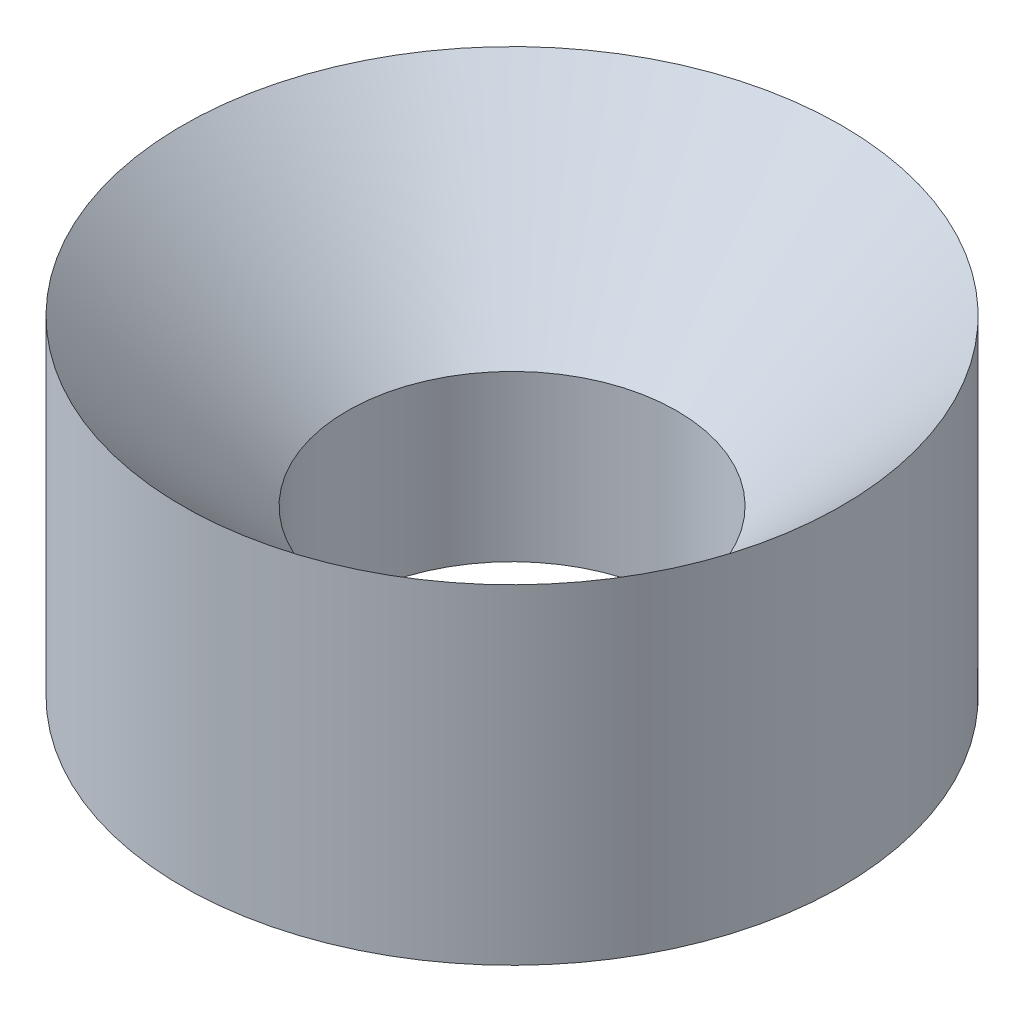
ISO-10303-21;
HEADER;
FILE_DESCRIPTION(('STEP AP214'),'2;1');
FILE_NAME('part.step','',(''),(''),'','','');
FILE_SCHEMA(('AUTOMOTIVE_DESIGN { 1 0 10303 214 1 1 1 1 }'));
ENDSEC;
DATA;
#1=APPLICATION_CONTEXT('core data for automotive mechanical design processes');
#2=APPLICATION_PROTOCOL_DEFINITION('international standard','automotive_design',2000,#1);
#3=PRODUCT_CONTEXT('',#1,'mechanical');
#4=PRODUCT('Part','Part','',(#3));
#5=PRODUCT_RELATED_PRODUCT_CATEGORY('part','',(#4));
#6=PRODUCT_DEFINITION_FORMATION('','',#4);
#7=PRODUCT_DEFINITION_CONTEXT('part definition',#1,'design');
#8=PRODUCT_DEFINITION('design','',#6,#7);
#9=PRODUCT_DEFINITION_SHAPE('','',#8);
#10=(LENGTH_UNIT() NAMED_UNIT(*) SI_UNIT(.MILLI.,.METRE.));
#11=(NAMED_UNIT(*) PLANE_ANGLE_UNIT() SI_UNIT($,.RADIAN.));
#12=(NAMED_UNIT(*) SI_UNIT($,.STERADIAN.) SOLID_ANGLE_UNIT());
#13=UNCERTAINTY_MEASURE_WITH_UNIT(LENGTH_MEASURE(1.E-05),#10,'distance_accuracy_value','');
#14=(GEOMETRIC_REPRESENTATION_CONTEXT(3) GLOBAL_UNCERTAINTY_ASSIGNED_CONTEXT((#13)) GLOBAL_UNIT_ASSIGNED_CONTEXT((#10,
#11,#12)) REPRESENTATION_CONTEXT('',''));
#15=CARTESIAN_POINT('',(0.,0.,0.));
#16=DIRECTION('',(0.,0.,1.));
#17=DIRECTION('',(1.,0.,0.));
#18=AXIS2_PLACEMENT_3D('',#15,#16,#17);
#19=CARTESIAN_POINT('',(0.,0.,0.));
#20=DIRECTION('',(0.,-1.,0.));
#21=DIRECTION('',(0.,0.,-1.));
#22=AXIS2_PLACEMENT_3D('',#19,#20,#21);
#23=PLANE('',#22);
#24=CARTESIAN_POINT('',(0.,0.,40.));
#25=DIRECTION('',(0.,-1.,0.));
#26=DIRECTION('',(0.,0.,-1.));
#27=AXIS2_PLACEMENT_3D('',#24,#25,#26);
#28=CIRCLE('',#27,40.);
#29=CARTESIAN_POINT('',(0.,0.,0.));
#30=VERTEX_POINT('',#29);
#31=EDGE_CURVE('E72',#30,#30,#28,.T.);
#32=ORIENTED_EDGE('',*,*,#31,.T.);
#33=EDGE_LOOP('',(#32));
#34=FACE_BOUND('',#33,.T.);
#35=CARTESIAN_POINT('',(0.,0.,40.));
#36=DIRECTION('',(0.,-1.,0.));
#37=DIRECTION('',(0.,0.,-1.));
#38=AXIS2_PLACEMENT_3D('',#35,#36,#37);
#39=CIRCLE('',#38,20.);
#40=CARTESIAN_POINT('',(0.,0.,20.));
#41=VERTEX_POINT('',#40);
#42=EDGE_CURVE('E12',#41,#41,#39,.T.);
#43=ORIENTED_EDGE('',*,*,#42,.F.);
#44=EDGE_LOOP('',(#43));
#45=FACE_BOUND('',#44,.T.);
#46=ADVANCED_FACE('F55',(#34,#45),#23,.T.);
#47=CARTESIAN_POINT('',(0.,0.,40.));
#48=DIRECTION('',(0.,-1.,0.));
#49=DIRECTION('',(0.,0.,-1.));
#50=AXIS2_PLACEMENT_3D('',#47,#48,#49);
#51=CYLINDRICAL_SURFACE('',#50,20.);
#52=ORIENTED_EDGE('',*,*,#42,.T.);
#53=EDGE_LOOP('',(#52));
#54=FACE_BOUND('',#53,.T.);
#55=CARTESIAN_POINT('',(0.,20.,40.));
#56=DIRECTION('',(0.,-1.,0.));
#57=DIRECTION('',(0.,0.,-1.));
#58=AXIS2_PLACEMENT_3D('',#55,#56,#57);
#59=CIRCLE('',#58,20.);
#60=CARTESIAN_POINT('',(0.,20.,20.));
#61=VERTEX_POINT('',#60);
#62=EDGE_CURVE('E62',#61,#61,#59,.T.);
#63=ORIENTED_EDGE('',*,*,#62,.F.);
#64=EDGE_LOOP('',(#63));
#65=FACE_BOUND('',#64,.T.);
#66=ADVANCED_FACE('F89',(#54,#65),#51,.F.);
#67=CARTESIAN_POINT('',(0.,40.,40.));
#68=DIRECTION('',(0.,1.,0.));
#69=DIRECTION('',(0.,0.,1.));
#70=AXIS2_PLACEMENT_3D('',#67,#68,#69);
#71=CONICAL_SURFACE('',#70,40.,0.785398163397448);
#72=ORIENTED_EDGE('',*,*,#62,.T.);
#73=EDGE_LOOP('',(#72));
#74=FACE_BOUND('',#73,.T.);
#75=CARTESIAN_POINT('',(0.,40.,40.));
#76=DIRECTION('',(0.,-1.,0.));
#77=DIRECTION('',(0.,0.,-1.));
#78=AXIS2_PLACEMENT_3D('',#75,#76,#77);
#79=CIRCLE('',#78,40.);
#80=CARTESIAN_POINT('',(0.,40.,0.));
#81=VERTEX_POINT('',#80);
#82=EDGE_CURVE('E67',#81,#81,#79,.T.);
#83=ORIENTED_EDGE('',*,*,#82,.F.);
#84=EDGE_LOOP('',(#83));
#85=FACE_BOUND('',#84,.T.);
#86=ADVANCED_FACE('F83',(#74,#85),#71,.F.);
#87=CARTESIAN_POINT('',(0.,0.,40.));
#88=DIRECTION('',(0.,-1.,0.));
#89=DIRECTION('',(0.,0.,-1.));
#90=AXIS2_PLACEMENT_3D('',#87,#88,#89);
#91=CYLINDRICAL_SURFACE('',#90,40.);
#92=ORIENTED_EDGE('',*,*,#82,.T.);
#93=EDGE_LOOP('',(#92));
#94=FACE_BOUND('',#93,.T.);
#95=ORIENTED_EDGE('',*,*,#31,.F.);
#96=EDGE_LOOP('',(#95));
#97=FACE_BOUND('',#96,.T.);
#98=ADVANCED_FACE('F81',(#94,#97),#91,.T.);
#99=CLOSED_SHELL('',(#46,#66,#86,#98));
#100=MANIFOLD_SOLID_BREP('B2',#99);
#101=ADVANCED_BREP_SHAPE_REPRESENTATION('',(#18,#100),#14);
#102=SHAPE_DEFINITION_REPRESENTATION(#9,#101);
ENDSEC;
END-ISO-10303-21;
